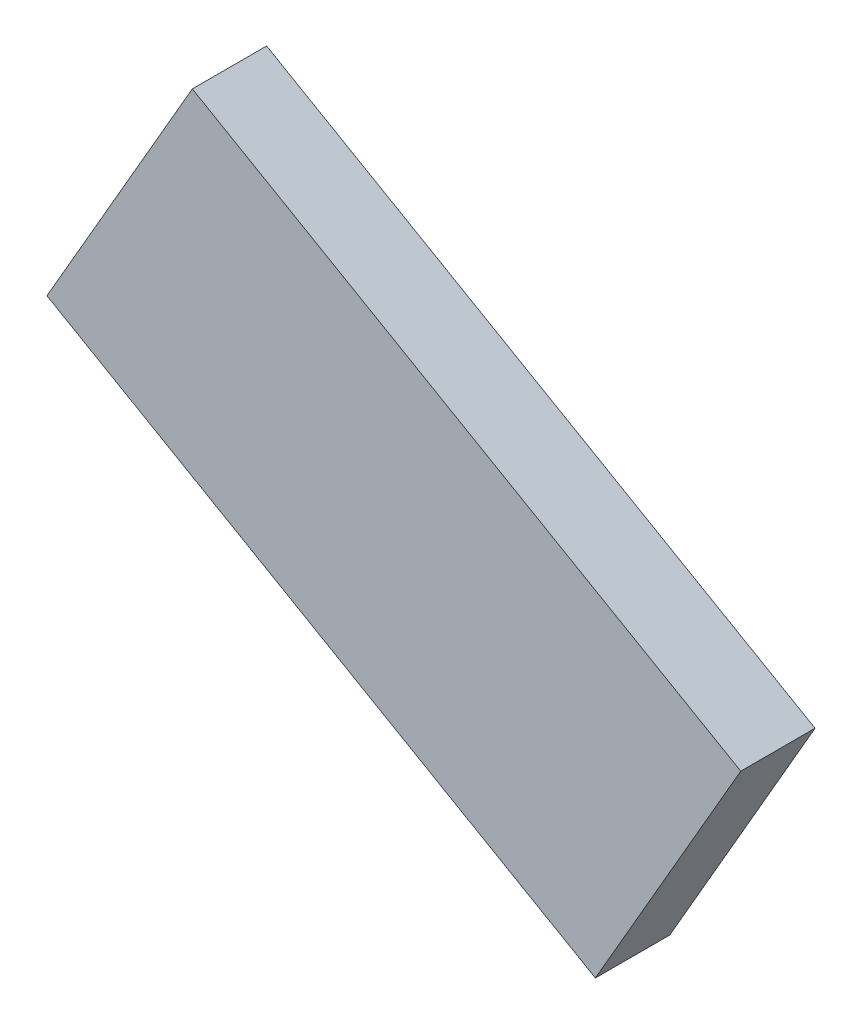
ISO-10303-21;
HEADER;
FILE_DESCRIPTION(('STEP AP214'),'2;1');
FILE_NAME('part.step','',(''),(''),'','','');
FILE_SCHEMA(('AUTOMOTIVE_DESIGN { 1 0 10303 214 1 1 1 1 }'));
ENDSEC;
DATA;
#1=APPLICATION_CONTEXT('core data for automotive mechanical design processes');
#2=APPLICATION_PROTOCOL_DEFINITION('international standard','automotive_design',2000,#1);
#3=PRODUCT_CONTEXT('',#1,'mechanical');
#4=PRODUCT('Part','Part','',(#3));
#5=PRODUCT_RELATED_PRODUCT_CATEGORY('part','',(#4));
#6=PRODUCT_DEFINITION_FORMATION('','',#4);
#7=PRODUCT_DEFINITION_CONTEXT('part definition',#1,'design');
#8=PRODUCT_DEFINITION('design','',#6,#7);
#9=PRODUCT_DEFINITION_SHAPE('','',#8);
#10=(LENGTH_UNIT() NAMED_UNIT(*) SI_UNIT(.MILLI.,.METRE.));
#11=(NAMED_UNIT(*) PLANE_ANGLE_UNIT() SI_UNIT($,.RADIAN.));
#12=(NAMED_UNIT(*) SI_UNIT($,.STERADIAN.) SOLID_ANGLE_UNIT());
#13=UNCERTAINTY_MEASURE_WITH_UNIT(LENGTH_MEASURE(1.E-05),#10,'distance_accuracy_value','');
#14=(GEOMETRIC_REPRESENTATION_CONTEXT(3) GLOBAL_UNCERTAINTY_ASSIGNED_CONTEXT((#13)) GLOBAL_UNIT_ASSIGNED_CONTEXT((#10,
#11,#12)) REPRESENTATION_CONTEXT('',''));
#15=CARTESIAN_POINT('',(0.,0.,0.));
#16=DIRECTION('',(0.,0.,1.));
#17=DIRECTION('',(1.,0.,0.));
#18=AXIS2_PLACEMENT_3D('',#15,#16,#17);
#19=CARTESIAN_POINT('',(5.36852622,-0.50144172,1.15000024));
#20=DIRECTION('',(0.,0.,-1.));
#21=DIRECTION('',(-1.,0.,0.));
#22=AXIS2_PLACEMENT_3D('',#19,#20,#21);
#23=PLANE('',#22);
#24=DIRECTION('',(0.500000090607198,0.866025351472342,0.));
#25=VECTOR('',#24,1.);
#26=CARTESIAN_POINT('',(-3.1185231,4.39855864,1.15000024));
#27=LINE('',#26,#25);
#28=CARTESIAN_POINT('',(-3.11852309999984,4.39855864000029,1.15000024));
#29=VERTEX_POINT('',#28);
#30=CARTESIAN_POINT('',(-5.36852367999981,0.501444259999892,1.15000024));
#31=VERTEX_POINT('',#30);
#32=EDGE_CURVE('E55',#29,#31,#27,.F.);
#33=ORIENTED_EDGE('',*,*,#32,.T.);
#34=DIRECTION('',(-0.866025397135755,0.500000011515858,0.));
#35=VECTOR('',#34,1.);
#36=CARTESIAN_POINT('',(-5.36852368,0.50144426,1.15000024));
#37=LINE('',#36,#35);
#38=CARTESIAN_POINT('',(3.11852563999984,-4.39855610000029,1.15000024));
#39=VERTEX_POINT('',#38);
#40=EDGE_CURVE('E57',#31,#39,#37,.F.);
#41=ORIENTED_EDGE('',*,*,#40,.T.);
#42=DIRECTION('',(-0.500000090607198,-0.866025351472342,0.));
#43=VECTOR('',#42,1.);
#44=CARTESIAN_POINT('',(3.11852564,-4.3985561,1.15000024));
#45=LINE('',#44,#43);
#46=CARTESIAN_POINT('',(5.36852621999963,-0.501441719999784,1.15000024));
#47=VERTEX_POINT('',#46);
#48=EDGE_CURVE('E20',#39,#47,#45,.F.);
#49=ORIENTED_EDGE('',*,*,#48,.T.);
#50=DIRECTION('',(0.866025397135755,-0.500000011515858,0.));
#51=VECTOR('',#50,1.);
#52=CARTESIAN_POINT('',(5.36852622,-0.50144172,1.15000024));
#53=LINE('',#52,#51);
#54=EDGE_CURVE('E80',#47,#29,#53,.F.);
#55=ORIENTED_EDGE('',*,*,#54,.T.);
#56=EDGE_LOOP('',(#33,#41,#49,#55));
#57=FACE_BOUND('',#56,.T.);
#58=ADVANCED_FACE('F17',(#57),#23,.F.);
#59=CARTESIAN_POINT('',(3.11852564,-4.3985561,0.));
#60=DIRECTION('',(-0.866025351472342,0.500000090607198,0.));
#61=DIRECTION('',(-0.500000090607198,-0.866025351472342,0.));
#62=AXIS2_PLACEMENT_3D('',#59,#60,#61);
#63=PLANE('',#62);
#64=DIRECTION('',(0.,0.,1.));
#65=VECTOR('',#64,1.);
#66=CARTESIAN_POINT('',(5.36852622,-0.50144172,0.));
#67=LINE('',#66,#65);
#68=CARTESIAN_POINT('',(5.36852621999963,-0.501441719999784,0.));
#69=VERTEX_POINT('',#68);
#70=EDGE_CURVE('E68',#69,#47,#67,.T.);
#71=ORIENTED_EDGE('',*,*,#70,.T.);
#72=ORIENTED_EDGE('',*,*,#48,.F.);
#73=DIRECTION('',(0.,0.,1.));
#74=VECTOR('',#73,1.);
#75=CARTESIAN_POINT('',(3.11852563999934,-4.39855610000114,0.));
#76=LINE('',#75,#74);
#77=CARTESIAN_POINT('',(3.11852563999984,-4.39855610000029,0.));
#78=VERTEX_POINT('',#77);
#79=EDGE_CURVE('E63',#39,#78,#76,.F.);
#80=ORIENTED_EDGE('',*,*,#79,.T.);
#81=DIRECTION('',(-0.500000090607363,-0.866025351472247,0.));
#82=VECTOR('',#81,1.);
#83=CARTESIAN_POINT('',(5.36852622,-0.50144172,0.));
#84=LINE('',#83,#82);
#85=EDGE_CURVE('E83',#69,#78,#84,.T.);
#86=ORIENTED_EDGE('',*,*,#85,.F.);
#87=EDGE_LOOP('',(#71,#72,#80,#86));
#88=FACE_BOUND('',#87,.T.);
#89=ADVANCED_FACE('F65',(#88),#63,.F.);
#90=CARTESIAN_POINT('',(-5.36852368,0.50144426,0.));
#91=DIRECTION('',(0.500000011515858,0.866025397135755,0.));
#92=DIRECTION('',(-0.866025397135755,0.500000011515858,0.));
#93=AXIS2_PLACEMENT_3D('',#90,#91,#92);
#94=PLANE('',#93);
#95=ORIENTED_EDGE('',*,*,#79,.F.);
#96=ORIENTED_EDGE('',*,*,#40,.F.);
#97=DIRECTION('',(0.,0.,1.));
#98=VECTOR('',#97,1.);
#99=CARTESIAN_POINT('',(-5.36852367999925,0.501444259999569,0.));
#100=LINE('',#99,#98);
#101=CARTESIAN_POINT('',(-5.36852367999981,0.501444259999892,0.));
#102=VERTEX_POINT('',#101);
#103=EDGE_CURVE('E75',#31,#102,#100,.F.);
#104=ORIENTED_EDGE('',*,*,#103,.T.);
#105=DIRECTION('',(-0.866025397135822,0.500000011515742,0.));
#106=VECTOR('',#105,1.);
#107=CARTESIAN_POINT('',(3.11852564,-4.3985561,0.));
#108=LINE('',#107,#106);
#109=EDGE_CURVE('E72',#78,#102,#108,.T.);
#110=ORIENTED_EDGE('',*,*,#109,.F.);
#111=EDGE_LOOP('',(#95,#96,#104,#110));
#112=FACE_BOUND('',#111,.T.);
#113=ADVANCED_FACE('F70',(#112),#94,.F.);
#114=CARTESIAN_POINT('',(-3.1185231,4.39855864,0.));
#115=DIRECTION('',(0.866025351472342,-0.500000090607198,0.));
#116=DIRECTION('',(0.500000090607198,0.866025351472342,0.));
#117=AXIS2_PLACEMENT_3D('',#114,#115,#116);
#118=PLANE('',#117);
#119=ORIENTED_EDGE('',*,*,#103,.F.);
#120=ORIENTED_EDGE('',*,*,#32,.F.);
#121=DIRECTION('',(0.,0.,1.));
#122=VECTOR('',#121,1.);
#123=CARTESIAN_POINT('',(-3.11852309999934,4.39855864000114,0.));
#124=LINE('',#123,#122);
#125=CARTESIAN_POINT('',(-3.11852309999984,4.39855864000029,0.));
#126=VERTEX_POINT('',#125);
#127=EDGE_CURVE('E35',#29,#126,#124,.F.);
#128=ORIENTED_EDGE('',*,*,#127,.T.);
#129=DIRECTION('',(0.500000090607363,0.866025351472247,0.));
#130=VECTOR('',#129,1.);
#131=CARTESIAN_POINT('',(-5.36852368,0.50144426,0.));
#132=LINE('',#131,#130);
#133=EDGE_CURVE('E26',#102,#126,#132,.T.);
#134=ORIENTED_EDGE('',*,*,#133,.F.);
#135=EDGE_LOOP('',(#119,#120,#128,#134));
#136=FACE_BOUND('',#135,.T.);
#137=ADVANCED_FACE('F89',(#136),#118,.F.);
#138=CARTESIAN_POINT('',(5.36852622,-0.50144172,0.));
#139=DIRECTION('',(-0.500000011515858,-0.866025397135755,0.));
#140=DIRECTION('',(0.866025397135755,-0.500000011515858,0.));
#141=AXIS2_PLACEMENT_3D('',#138,#139,#140);
#142=PLANE('',#141);
#143=ORIENTED_EDGE('',*,*,#127,.F.);
#144=ORIENTED_EDGE('',*,*,#54,.F.);
#145=ORIENTED_EDGE('',*,*,#70,.F.);
#146=DIRECTION('',(0.866025397135822,-0.500000011515742,0.));
#147=VECTOR('',#146,1.);
#148=CARTESIAN_POINT('',(-3.1185231,4.39855864,0.));
#149=LINE('',#148,#147);
#150=EDGE_CURVE('E11',#126,#69,#149,.T.);
#151=ORIENTED_EDGE('',*,*,#150,.F.);
#152=EDGE_LOOP('',(#143,#144,#145,#151));
#153=FACE_BOUND('',#152,.T.);
#154=ADVANCED_FACE('F91',(#153),#142,.F.);
#155=CARTESIAN_POINT('',(5.36852622,-0.50144172,0.));
#156=DIRECTION('',(0.,0.,-1.));
#157=DIRECTION('',(-1.,0.,0.));
#158=AXIS2_PLACEMENT_3D('',#155,#156,#157);
#159=PLANE('',#158);
#160=ORIENTED_EDGE('',*,*,#133,.T.);
#161=ORIENTED_EDGE('',*,*,#150,.T.);
#162=ORIENTED_EDGE('',*,*,#85,.T.);
#163=ORIENTED_EDGE('',*,*,#109,.T.);
#164=EDGE_LOOP('',(#160,#161,#162,#163));
#165=FACE_BOUND('',#164,.T.);
#166=ADVANCED_FACE('F88',(#165),#159,.T.);
#167=CLOSED_SHELL('',(#58,#89,#113,#137,#154,#166));
#168=MANIFOLD_SOLID_BREP('B1',#167);
#169=ADVANCED_BREP_SHAPE_REPRESENTATION('',(#18,#168),#14);
#170=SHAPE_DEFINITION_REPRESENTATION(#9,#169);
ENDSEC;
END-ISO-10303-21;
